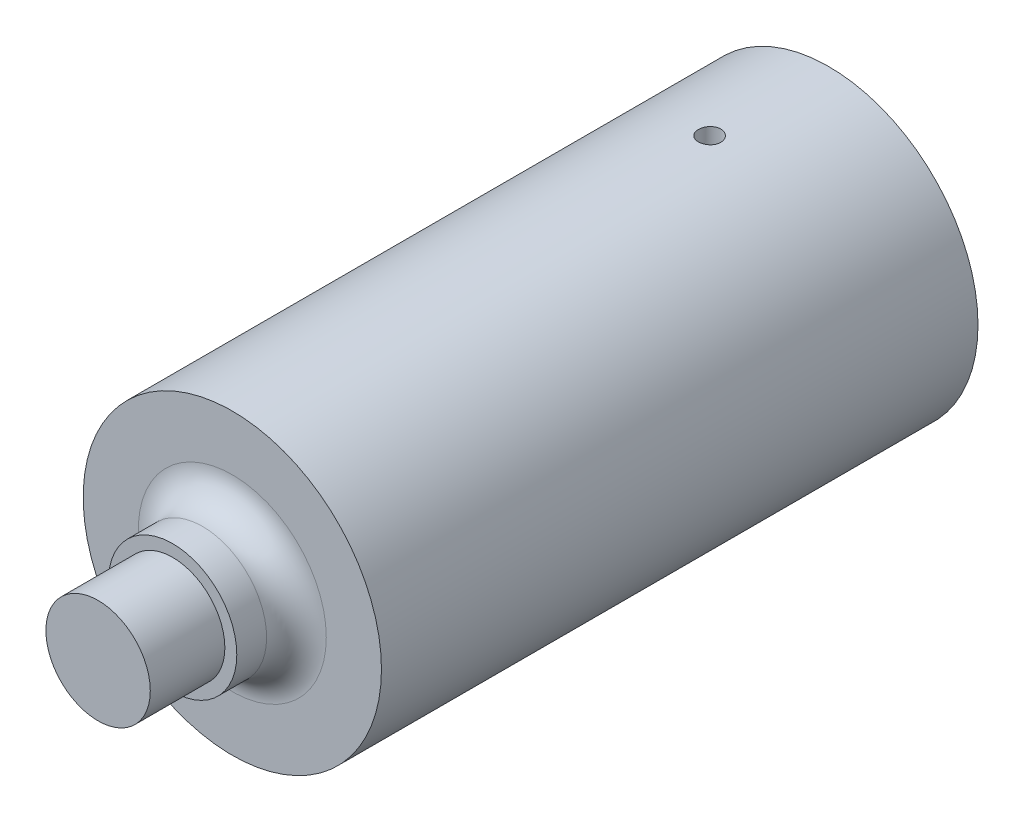
ISO-10303-21;
HEADER;
FILE_DESCRIPTION(('STEP AP214'),'2;1');
FILE_NAME('part.step','',(''),(''),'','','');
FILE_SCHEMA(('AUTOMOTIVE_DESIGN { 1 0 10303 214 1 1 1 1 }'));
ENDSEC;
DATA;
#1=APPLICATION_CONTEXT('core data for automotive mechanical design processes');
#2=APPLICATION_PROTOCOL_DEFINITION('international standard','automotive_design',2000,#1);
#3=PRODUCT_CONTEXT('',#1,'mechanical');
#4=PRODUCT('Part','Part','',(#3));
#5=PRODUCT_RELATED_PRODUCT_CATEGORY('part','',(#4));
#6=PRODUCT_DEFINITION_FORMATION('','',#4);
#7=PRODUCT_DEFINITION_CONTEXT('part definition',#1,'design');
#8=PRODUCT_DEFINITION('design','',#6,#7);
#9=PRODUCT_DEFINITION_SHAPE('','',#8);
#10=(LENGTH_UNIT() NAMED_UNIT(*) SI_UNIT(.MILLI.,.METRE.));
#11=(NAMED_UNIT(*) PLANE_ANGLE_UNIT() SI_UNIT($,.RADIAN.));
#12=(NAMED_UNIT(*) SI_UNIT($,.STERADIAN.) SOLID_ANGLE_UNIT());
#13=UNCERTAINTY_MEASURE_WITH_UNIT(LENGTH_MEASURE(1.E-05),#10,'distance_accuracy_value','');
#14=(GEOMETRIC_REPRESENTATION_CONTEXT(3) GLOBAL_UNCERTAINTY_ASSIGNED_CONTEXT((#13)) GLOBAL_UNIT_ASSIGNED_CONTEXT((#10,
#11,#12)) REPRESENTATION_CONTEXT('',''));
#15=CARTESIAN_POINT('',(0.,0.,0.));
#16=DIRECTION('',(0.,0.,1.));
#17=DIRECTION('',(1.,0.,0.));
#18=AXIS2_PLACEMENT_3D('',#15,#16,#17);
#19=CARTESIAN_POINT('',(2.07846096908265,-3.6,40.));
#20=DIRECTION('',(-0.866025403784439,0.5,0.));
#21=DIRECTION('',(-0.5,-0.866025403784439,0.));
#22=AXIS2_PLACEMENT_3D('',#19,#20,#21);
#23=PLANE('',#22);
#24=DIRECTION('',(0.,0.,-1.));
#25=VECTOR('',#24,1.);
#26=CARTESIAN_POINT('',(2.07846096908265,-3.6,40.));
#27=LINE('',#26,#25);
#28=CARTESIAN_POINT('',(2.07846096908265,-3.6,20.));
#29=VERTEX_POINT('',#28);
#30=CARTESIAN_POINT('',(2.07846096908265,-3.6,0.));
#31=VERTEX_POINT('',#30);
#32=EDGE_CURVE('E55',#29,#31,#27,.T.);
#33=ORIENTED_EDGE('',*,*,#32,.F.);
#34=DIRECTION('',(0.5,0.866025403784439,0.));
#35=VECTOR('',#34,1.);
#36=CARTESIAN_POINT('',(2.07846096908265,-3.6,20.));
#37=LINE('',#36,#35);
#38=CARTESIAN_POINT('',(4.15692193816531,0.,20.));
#39=VERTEX_POINT('',#38);
#40=EDGE_CURVE('E48',#29,#39,#37,.T.);
#41=ORIENTED_EDGE('',*,*,#40,.T.);
#42=DIRECTION('',(0.,0.,-1.));
#43=VECTOR('',#42,1.);
#44=CARTESIAN_POINT('',(4.15692193816531,0.,40.));
#45=LINE('',#44,#43);
#46=CARTESIAN_POINT('',(4.15692193816531,0.,0.));
#47=VERTEX_POINT('',#46);
#48=EDGE_CURVE('E114',#39,#47,#45,.T.);
#49=ORIENTED_EDGE('',*,*,#48,.T.);
#50=DIRECTION('',(0.5,0.866025403784439,0.));
#51=VECTOR('',#50,1.);
#52=CARTESIAN_POINT('',(2.07846096908265,-3.6,0.));
#53=LINE('',#52,#51);
#54=EDGE_CURVE('E183',#31,#47,#53,.T.);
#55=ORIENTED_EDGE('',*,*,#54,.F.);
#56=EDGE_LOOP('',(#33,#41,#49,#55));
#57=FACE_BOUND('',#56,.T.);
#58=ADVANCED_FACE('F33',(#57),#23,.T.);
#59=CARTESIAN_POINT('',(4.15692193816531,0.,40.));
#60=DIRECTION('',(-0.866025403784438,-0.5,0.));
#61=DIRECTION('',(0.5,-0.866025403784439,0.));
#62=AXIS2_PLACEMENT_3D('',#59,#60,#61);
#63=PLANE('',#62);
#64=ORIENTED_EDGE('',*,*,#48,.F.);
#65=DIRECTION('',(-0.5,0.866025403784439,0.));
#66=VECTOR('',#65,1.);
#67=CARTESIAN_POINT('',(4.15692193816531,0.,20.));
#68=LINE('',#67,#66);
#69=CARTESIAN_POINT('',(2.07846096908265,3.6,20.));
#70=VERTEX_POINT('',#69);
#71=EDGE_CURVE('E220',#39,#70,#68,.T.);
#72=ORIENTED_EDGE('',*,*,#71,.T.);
#73=DIRECTION('',(0.,0.,-1.));
#74=VECTOR('',#73,1.);
#75=CARTESIAN_POINT('',(2.07846096908265,3.6,40.));
#76=LINE('',#75,#74);
#77=CARTESIAN_POINT('',(2.07846096908265,3.6,0.));
#78=VERTEX_POINT('',#77);
#79=EDGE_CURVE('E112',#70,#78,#76,.T.);
#80=ORIENTED_EDGE('',*,*,#79,.T.);
#81=DIRECTION('',(-0.5,0.866025403784438,0.));
#82=VECTOR('',#81,1.);
#83=CARTESIAN_POINT('',(4.15692193816531,0.,0.));
#84=LINE('',#83,#82);
#85=EDGE_CURVE('E218',#47,#78,#84,.T.);
#86=ORIENTED_EDGE('',*,*,#85,.F.);
#87=EDGE_LOOP('',(#64,#72,#80,#86));
#88=FACE_BOUND('',#87,.T.);
#89=ADVANCED_FACE('F145',(#88),#63,.T.);
#90=CARTESIAN_POINT('',(2.07846096908265,3.6,40.));
#91=DIRECTION('',(0.,-1.,0.));
#92=DIRECTION('',(1.,0.,0.));
#93=AXIS2_PLACEMENT_3D('',#90,#91,#92);
#94=PLANE('',#93);
#95=CARTESIAN_POINT('',(0.,3.6,8.));
#96=DIRECTION('',(0.,-1.,0.));
#97=DIRECTION('',(1.,0.,0.));
#98=AXIS2_PLACEMENT_3D('',#95,#96,#97);
#99=CIRCLE('',#98,0.75);
#100=CARTESIAN_POINT('',(0.750000000000001,3.6,8.));
#101=VERTEX_POINT('',#100);
#102=EDGE_CURVE('E123',#101,#101,#99,.F.);
#103=ORIENTED_EDGE('',*,*,#102,.T.);
#104=EDGE_LOOP('',(#103));
#105=FACE_BOUND('',#104,.T.);
#106=ORIENTED_EDGE('',*,*,#79,.F.);
#107=DIRECTION('',(-1.,0.,0.));
#108=VECTOR('',#107,1.);
#109=CARTESIAN_POINT('',(2.07846096908265,3.6,20.));
#110=LINE('',#109,#108);
#111=CARTESIAN_POINT('',(-2.07846096908265,3.6,20.));
#112=VERTEX_POINT('',#111);
#113=EDGE_CURVE('E210',#70,#112,#110,.T.);
#114=ORIENTED_EDGE('',*,*,#113,.T.);
#115=DIRECTION('',(0.,0.,-1.));
#116=VECTOR('',#115,1.);
#117=CARTESIAN_POINT('',(-2.07846096908265,3.6,40.));
#118=LINE('',#117,#116);
#119=CARTESIAN_POINT('',(-2.07846096908265,3.6,0.));
#120=VERTEX_POINT('',#119);
#121=EDGE_CURVE('E106',#112,#120,#118,.T.);
#122=ORIENTED_EDGE('',*,*,#121,.T.);
#123=DIRECTION('',(-1.,0.,0.));
#124=VECTOR('',#123,1.);
#125=CARTESIAN_POINT('',(2.07846096908265,3.6,0.));
#126=LINE('',#125,#124);
#127=EDGE_CURVE('E213',#78,#120,#126,.T.);
#128=ORIENTED_EDGE('',*,*,#127,.F.);
#129=EDGE_LOOP('',(#106,#114,#122,#128));
#130=FACE_BOUND('',#129,.T.);
#131=ADVANCED_FACE('F151',(#105,#130),#94,.T.);
#132=CARTESIAN_POINT('',(-2.07846096908265,3.6,40.));
#133=DIRECTION('',(0.866025403784439,-0.5,0.));
#134=DIRECTION('',(0.5,0.866025403784439,0.));
#135=AXIS2_PLACEMENT_3D('',#132,#133,#134);
#136=PLANE('',#135);
#137=ORIENTED_EDGE('',*,*,#121,.F.);
#138=DIRECTION('',(-0.5,-0.866025403784439,0.));
#139=VECTOR('',#138,1.);
#140=CARTESIAN_POINT('',(-2.07846096908265,3.6,20.));
#141=LINE('',#140,#139);
#142=CARTESIAN_POINT('',(-4.1569219381653,0.,20.));
#143=VERTEX_POINT('',#142);
#144=EDGE_CURVE('E98',#112,#143,#141,.T.);
#145=ORIENTED_EDGE('',*,*,#144,.T.);
#146=DIRECTION('',(0.,0.,-1.));
#147=VECTOR('',#146,1.);
#148=CARTESIAN_POINT('',(-4.1569219381653,0.,40.));
#149=LINE('',#148,#147);
#150=CARTESIAN_POINT('',(-4.1569219381653,0.,0.));
#151=VERTEX_POINT('',#150);
#152=EDGE_CURVE('E97',#143,#151,#149,.T.);
#153=ORIENTED_EDGE('',*,*,#152,.T.);
#154=DIRECTION('',(-0.5,-0.866025403784439,0.));
#155=VECTOR('',#154,1.);
#156=CARTESIAN_POINT('',(-2.07846096908265,3.6,0.));
#157=LINE('',#156,#155);
#158=EDGE_CURVE('E351',#120,#151,#157,.T.);
#159=ORIENTED_EDGE('',*,*,#158,.F.);
#160=EDGE_LOOP('',(#137,#145,#153,#159));
#161=FACE_BOUND('',#160,.T.);
#162=ADVANCED_FACE('F197',(#161),#136,.T.);
#163=CARTESIAN_POINT('',(-4.1569219381653,0.,40.));
#164=DIRECTION('',(0.866025403784439,0.5,0.));
#165=DIRECTION('',(-0.5,0.866025403784439,0.));
#166=AXIS2_PLACEMENT_3D('',#163,#164,#165);
#167=PLANE('',#166);
#168=ORIENTED_EDGE('',*,*,#152,.F.);
#169=DIRECTION('',(0.5,-0.866025403784439,0.));
#170=VECTOR('',#169,1.);
#171=CARTESIAN_POINT('',(-4.1569219381653,0.,20.));
#172=LINE('',#171,#170);
#173=CARTESIAN_POINT('',(-2.07846096908265,-3.6,20.));
#174=VERTEX_POINT('',#173);
#175=EDGE_CURVE('E87',#143,#174,#172,.T.);
#176=ORIENTED_EDGE('',*,*,#175,.T.);
#177=DIRECTION('',(0.,0.,-1.));
#178=VECTOR('',#177,1.);
#179=CARTESIAN_POINT('',(-2.07846096908265,-3.6,40.));
#180=LINE('',#179,#178);
#181=CARTESIAN_POINT('',(-2.07846096908265,-3.6,0.));
#182=VERTEX_POINT('',#181);
#183=EDGE_CURVE('E96',#174,#182,#180,.T.);
#184=ORIENTED_EDGE('',*,*,#183,.T.);
#185=DIRECTION('',(0.5,-0.866025403784439,0.));
#186=VECTOR('',#185,1.);
#187=CARTESIAN_POINT('',(-4.1569219381653,0.,0.));
#188=LINE('',#187,#186);
#189=EDGE_CURVE('E353',#151,#182,#188,.T.);
#190=ORIENTED_EDGE('',*,*,#189,.F.);
#191=EDGE_LOOP('',(#168,#176,#184,#190));
#192=FACE_BOUND('',#191,.T.);
#193=ADVANCED_FACE('F94',(#192),#167,.T.);
#194=CARTESIAN_POINT('',(-2.07846096908265,-3.6,40.));
#195=DIRECTION('',(0.,1.,0.));
#196=DIRECTION('',(0.,0.,1.));
#197=AXIS2_PLACEMENT_3D('',#194,#195,#196);
#198=PLANE('',#197);
#199=CARTESIAN_POINT('',(0.,-3.6,8.));
#200=DIRECTION('',(0.,1.,0.));
#201=DIRECTION('',(0.,0.,1.));
#202=AXIS2_PLACEMENT_3D('',#199,#200,#201);
#203=CIRCLE('',#202,0.75);
#204=CARTESIAN_POINT('',(0.,-3.6,8.75));
#205=VERTEX_POINT('',#204);
#206=EDGE_CURVE('E121',#205,#205,#203,.F.);
#207=ORIENTED_EDGE('',*,*,#206,.T.);
#208=EDGE_LOOP('',(#207));
#209=FACE_BOUND('',#208,.T.);
#210=ORIENTED_EDGE('',*,*,#183,.F.);
#211=DIRECTION('',(1.,0.,0.));
#212=VECTOR('',#211,1.);
#213=CARTESIAN_POINT('',(-2.07846096908265,-3.6,20.));
#214=LINE('',#213,#212);
#215=EDGE_CURVE('E84',#174,#29,#214,.T.);
#216=ORIENTED_EDGE('',*,*,#215,.T.);
#217=ORIENTED_EDGE('',*,*,#32,.T.);
#218=DIRECTION('',(1.,0.,0.));
#219=VECTOR('',#218,1.);
#220=CARTESIAN_POINT('',(-2.07846096908265,-3.6,0.));
#221=LINE('',#220,#219);
#222=EDGE_CURVE('E103',#182,#31,#221,.T.);
#223=ORIENTED_EDGE('',*,*,#222,.F.);
#224=EDGE_LOOP('',(#210,#216,#217,#223));
#225=FACE_BOUND('',#224,.T.);
#226=ADVANCED_FACE('F101',(#209,#225),#198,.T.);
#227=CARTESIAN_POINT('',(0.,0.,40.));
#228=DIRECTION('',(0.,0.,-1.));
#229=DIRECTION('',(-1.,0.,0.));
#230=AXIS2_PLACEMENT_3D('',#227,#228,#229);
#231=CYLINDRICAL_SURFACE('',#230,10.);
#232=CARTESIAN_POINT('',(0.,0.,40.));
#233=DIRECTION('',(0.,0.,1.));
#234=DIRECTION('',(1.,0.,0.));
#235=AXIS2_PLACEMENT_3D('',#232,#233,#234);
#236=CIRCLE('',#235,10.);
#237=CARTESIAN_POINT('',(10.,0.,40.));
#238=VERTEX_POINT('',#237);
#239=EDGE_CURVE('E90',#238,#238,#236,.T.);
#240=ORIENTED_EDGE('',*,*,#239,.F.);
#241=EDGE_LOOP('',(#240));
#242=FACE_BOUND('',#241,.T.);
#243=CARTESIAN_POINT('',(0.,0.,0.));
#244=DIRECTION('',(0.,0.,1.));
#245=DIRECTION('',(1.,0.,0.));
#246=AXIS2_PLACEMENT_3D('',#243,#244,#245);
#247=CIRCLE('',#246,10.);
#248=CARTESIAN_POINT('',(10.,0.,0.));
#249=VERTEX_POINT('',#248);
#250=EDGE_CURVE('E116',#249,#249,#247,.T.);
#251=ORIENTED_EDGE('',*,*,#250,.T.);
#252=EDGE_LOOP('',(#251));
#253=FACE_BOUND('',#252,.T.);
#254=CARTESIAN_POINT('',(0.,-10.,7.25));
#255=CARTESIAN_POINT('',(0.0420644047557227,-9.99999962913644,7.25000184340851));
#256=CARTESIAN_POINT('',(0.0841578005120447,-9.9997317545379,7.2535507267203));
#257=CARTESIAN_POINT('',(0.16718097098577,-9.99868890393989,7.26765624227164));
#258=CARTESIAN_POINT('',(0.208109355581498,-9.99791334661944,7.27822090811849));
#259=CARTESIAN_POINT('',(0.28758798297991,-9.99594281342965,7.30605166405987));
#260=CARTESIAN_POINT('',(0.326139518467547,-9.99474806795054,7.32331407355425));
#261=CARTESIAN_POINT('',(0.39978824033901,-9.99207331235322,7.36404397643186));
#262=CARTESIAN_POINT('',(0.434886185899926,-9.99059336514136,7.38751010189798));
#263=CARTESIAN_POINT('',(0.500714478766273,-9.98751093449452,7.44003461026875));
#264=CARTESIAN_POINT('',(0.531436614859262,-9.98590822914549,7.46910327204211));
#265=CARTESIAN_POINT('',(0.587570826848911,-9.98276279192191,7.53198614867246));
#266=CARTESIAN_POINT('',(0.612982674521332,-9.98122006262731,7.56580056738703));
#267=CARTESIAN_POINT('',(0.657801919373829,-9.97836676979887,7.6372637274047));
#268=CARTESIAN_POINT('',(0.67720223405166,-9.977056480886,7.67491692251504));
#269=CARTESIAN_POINT('',(0.709402445233912,-9.97481880605083,7.7529576861719));
#270=CARTESIAN_POINT('',(0.722202438443439,-9.9738914145185,7.7933452146463));
#271=CARTESIAN_POINT('',(0.740815188289641,-9.9725262944501,7.87562694620028));
#272=CARTESIAN_POINT('',(0.746641155221086,-9.9720876402507,7.91751814540381));
#273=CARTESIAN_POINT('',(0.751181272874192,-9.97174669462697,8.00168597663035));
#274=CARTESIAN_POINT('',(0.749895534054289,-9.97184439487202,8.04396260265676));
#275=CARTESIAN_POINT('',(0.740259672087844,-9.97256428184655,8.12761090552694));
#276=CARTESIAN_POINT('',(0.731923878381972,-9.97318540469519,8.16898424348209));
#277=CARTESIAN_POINT('',(0.708446776134602,-9.97488047599021,8.24974284855779));
#278=CARTESIAN_POINT('',(0.693305412236681,-9.9759544281199,8.28912809950438));
#279=CARTESIAN_POINT('',(0.656630835948507,-9.97843536768068,8.36483835811942));
#280=CARTESIAN_POINT('',(0.635091163632483,-9.97984269140157,8.4011602250884));
#281=CARTESIAN_POINT('',(0.586236068717118,-9.98283147297571,8.46967833143244));
#282=CARTESIAN_POINT('',(0.558920551714386,-9.98441293367493,8.50187450336117));
#283=CARTESIAN_POINT('',(0.499208639216138,-9.98757651680734,8.56131062912179));
#284=CARTESIAN_POINT('',(0.466799850088158,-9.98915863121148,8.58853813379736));
#285=CARTESIAN_POINT('',(0.397864687967222,-9.99214150760496,8.63716788178285));
#286=CARTESIAN_POINT('',(0.361338312859297,-9.99354226950117,8.65857012210064));
#287=CARTESIAN_POINT('',(0.285196970108168,-9.99600480209642,8.69494091512188));
#288=CARTESIAN_POINT('',(0.245581754714489,-9.99706654556852,8.70990895112065));
#289=CARTESIAN_POINT('',(0.164390826387272,-9.99873107500663,8.73297790610242));
#290=CARTESIAN_POINT('',(0.122815146421287,-9.99933386868751,8.74107894051883));
#291=CARTESIAN_POINT('',(0.0389914218918759,-10.0000115867693,8.75016840476947));
#292=CARTESIAN_POINT('',(-0.00325474741266008,-10.0000877878789,8.75117403732709));
#293=CARTESIAN_POINT('',(-0.0873151154965314,-9.9997071385682,8.74608916596515));
#294=CARTESIAN_POINT('',(-0.129129317527298,-9.99925029216312,8.73999871549735));
#295=CARTESIAN_POINT('',(-0.211090005588251,-9.99785576876619,8.72090881559471));
#296=CARTESIAN_POINT('',(-0.251238350823034,-9.99691864430056,8.70791730472067));
#297=CARTESIAN_POINT('',(-0.328785163692013,-9.99466890454202,8.67540215318164));
#298=CARTESIAN_POINT('',(-0.366183595899698,-9.99335628441277,8.65587842838159));
#299=CARTESIAN_POINT('',(-0.437247479688379,-9.9904996627918,8.61080958105106));
#300=CARTESIAN_POINT('',(-0.470905660127773,-9.98895522387486,8.58525302164059));
#301=CARTESIAN_POINT('',(-0.533460298008509,-9.98581008196255,8.52886053726546));
#302=CARTESIAN_POINT('',(-0.562356688367402,-9.98420937817492,8.49802453793837));
#303=CARTESIAN_POINT('',(-0.61462617489577,-9.98112836879683,8.43187402993394));
#304=CARTESIAN_POINT('',(-0.637988073543826,-9.97964831120046,8.39655066028351));
#305=CARTESIAN_POINT('',(-0.67844872236304,-9.97697951427165,8.32247240080923));
#306=CARTESIAN_POINT('',(-0.695547524793443,-9.9757907725085,8.28371753962108));
#307=CARTESIAN_POINT('',(-0.722977396192289,-9.97384047836854,8.20391659625635));
#308=CARTESIAN_POINT('',(-0.733315403364552,-9.97307848815762,8.16287291007364));
#309=CARTESIAN_POINT('',(-0.746952846695885,-9.97206643262204,8.07962638449214));
#310=CARTESIAN_POINT('',(-0.75025238953694,-9.97181635953825,8.03742356267218));
#311=CARTESIAN_POINT('',(-0.749718107765774,-9.9718565345813,7.9531680433763));
#312=CARTESIAN_POINT('',(-0.745901880428615,-9.97214544979285,7.91111523255193));
#313=CARTESIAN_POINT('',(-0.731280990966987,-9.97322821847875,7.828249458145));
#314=CARTESIAN_POINT('',(-0.720476317216922,-9.97402207279308,7.7874364966251));
#315=CARTESIAN_POINT('',(-0.692189501367629,-9.97602492677799,7.7082071957891));
#316=CARTESIAN_POINT('',(-0.674707579204769,-9.97723391277475,7.66979077758373));
#317=CARTESIAN_POINT('',(-0.633564623098412,-9.9799308118954,7.59643552114272));
#318=CARTESIAN_POINT('',(-0.609903713405038,-9.98141871941042,7.5614966129991));
#319=CARTESIAN_POINT('',(-0.557008544733636,-9.98451015395811,7.49599832501448));
#320=CARTESIAN_POINT('',(-0.527761344100003,-9.98611394398152,7.46544940917995));
#321=CARTESIAN_POINT('',(-0.464545486726357,-9.98925406645788,7.40968297484458));
#322=CARTESIAN_POINT('',(-0.430575683897841,-9.99079038241667,7.38446675424697));
#323=CARTESIAN_POINT('',(-0.358825208301917,-9.99362470113832,7.34005441873044));
#324=CARTESIAN_POINT('',(-0.321038574133721,-9.99492232188758,7.32086791975448));
#325=CARTESIAN_POINT('',(-0.242796958957604,-9.99712833597881,7.28913585777985));
#326=CARTESIAN_POINT('',(-0.202345131868832,-9.99803718017026,7.27658259846587));
#327=CARTESIAN_POINT('',(-0.134708958362184,-9.99912781002897,7.26169900573653));
#328=CARTESIAN_POINT('',(-0.10796059646902,-9.9994534077319,7.25731764060529));
#329=CARTESIAN_POINT('',(-0.0541454939739934,-9.99988962186462,7.25146754742384));
#330=CARTESIAN_POINT('',(-0.0270787540345329,-10.0000002387416,7.24999881331482));
#331=CARTESIAN_POINT('',(0.,-10.,7.25));
#332=B_SPLINE_CURVE_WITH_KNOTS('',3,(#254,#255,#256,#257,#258,#259,#260,#261,#262,#263,#264,
#265,#266,#267,#268,#269,#270,#271,#272,#273,#274,#275,#276,#277,#278,#279,#280,#281,#282,#283,
#284,#285,#286,#287,#288,#289,#290,#291,#292,#293,#294,#295,#296,#297,#298,#299,#300,#301,#302,
#303,#304,#305,#306,#307,#308,#309,#310,#311,#312,#313,#314,#315,#316,#317,#318,#319,#320,#321,
#322,#323,#324,#325,#326,#327,#328,#329,#330,#331),.UNSPECIFIED.,.T.,.F.,(4,2,2,2,2,2,2,2,2,2,2,
2,2,2,2,2,2,2,2,2,2,2,2,2,2,2,2,2,2,2,2,2,2,2,2,2,2,2,4),(0.,0.126094353170702,
0.252333343558037,0.378503060068517,0.504644979372845,0.631020570667202,0.757401592183361,
0.883930948606271,1.01045845112212,1.13674590235185,1.26303139210068,1.38906081808215,
1.51509126920395,1.64124939949198,1.7674095919331,1.89388166818657,2.02035380940183,
2.14683610518214,2.27331627476949,2.39948968888266,2.52566215259152,2.65168978847614,
2.77771904766213,2.9039891760597,3.03026108315503,3.15678632557819,3.28331051225127,
3.4097046500346,3.53609687204868,3.66217694101203,3.78825721971578,3.9143333459235,
4.04040693712559,4.16677622314073,4.29317623036054,4.41977680385855,4.54623016281112,
4.62740295242378,4.70857557318191),.UNSPECIFIED.);
#333=CARTESIAN_POINT('',(0.,-10.,7.25));
#334=VERTEX_POINT('',#333);
#335=EDGE_CURVE('E170',#334,#334,#332,.T.);
#336=ORIENTED_EDGE('',*,*,#335,.F.);
#337=EDGE_LOOP('',(#336));
#338=FACE_BOUND('',#337,.T.);
#339=CARTESIAN_POINT('',(0.,10.,7.25));
#340=CARTESIAN_POINT('',(-0.0420644047557207,9.99999962913644,7.25000184340851));
#341=CARTESIAN_POINT('',(-0.0841578005120428,9.9997317545379,7.2535507267203));
#342=CARTESIAN_POINT('',(-0.167180970985768,9.99868890393989,7.26765624227164));
#343=CARTESIAN_POINT('',(-0.208109355581496,9.99791334661944,7.27822090811849));
#344=CARTESIAN_POINT('',(-0.287587982979908,9.99594281342965,7.30605166405987));
#345=CARTESIAN_POINT('',(-0.326139518467545,9.99474806795054,7.32331407355425));
#346=CARTESIAN_POINT('',(-0.399788240339009,9.99207331235322,7.36404397643186));
#347=CARTESIAN_POINT('',(-0.434886185899924,9.99059336514136,7.38751010189798));
#348=CARTESIAN_POINT('',(-0.500714478766271,9.98751093449452,7.44003461026875));
#349=CARTESIAN_POINT('',(-0.53143661485926,9.98590822914549,7.46910327204211));
#350=CARTESIAN_POINT('',(-0.587570826848909,9.98276279192191,7.53198614867246));
#351=CARTESIAN_POINT('',(-0.61298267452133,9.98122006262731,7.56580056738703));
#352=CARTESIAN_POINT('',(-0.657801919373827,9.97836676979887,7.6372637274047));
#353=CARTESIAN_POINT('',(-0.677202234051658,9.977056480886,7.67491692251504));
#354=CARTESIAN_POINT('',(-0.70940244523391,9.97481880605083,7.7529576861719));
#355=CARTESIAN_POINT('',(-0.722202438443437,9.9738914145185,7.7933452146463));
#356=CARTESIAN_POINT('',(-0.740815188289639,9.9725262944501,7.87562694620028));
#357=CARTESIAN_POINT('',(-0.746641155221084,9.9720876402507,7.91751814540381));
#358=CARTESIAN_POINT('',(-0.75118127287419,9.97174669462697,8.00168597663035));
#359=CARTESIAN_POINT('',(-0.749895534054287,9.97184439487202,8.04396260265676));
#360=CARTESIAN_POINT('',(-0.740259672087842,9.97256428184655,8.12761090552694));
#361=CARTESIAN_POINT('',(-0.73192387838197,9.97318540469519,8.16898424348209));
#362=CARTESIAN_POINT('',(-0.7084467761346,9.97488047599021,8.24974284855779));
#363=CARTESIAN_POINT('',(-0.693305412236679,9.9759544281199,8.28912809950438));
#364=CARTESIAN_POINT('',(-0.656630835948505,9.97843536768068,8.36483835811942));
#365=CARTESIAN_POINT('',(-0.635091163632481,9.97984269140157,8.4011602250884));
#366=CARTESIAN_POINT('',(-0.586236068717116,9.98283147297571,8.46967833143244));
#367=CARTESIAN_POINT('',(-0.558920551714384,9.98441293367493,8.50187450336117));
#368=CARTESIAN_POINT('',(-0.499208639216136,9.98757651680734,8.56131062912179));
#369=CARTESIAN_POINT('',(-0.466799850088156,9.98915863121148,8.58853813379736));
#370=CARTESIAN_POINT('',(-0.39786468796722,9.99214150760496,8.63716788178285));
#371=CARTESIAN_POINT('',(-0.361338312859295,9.99354226950117,8.65857012210064));
#372=CARTESIAN_POINT('',(-0.285196970108166,9.99600480209642,8.69494091512188));
#373=CARTESIAN_POINT('',(-0.245581754714488,9.99706654556852,8.70990895112065));
#374=CARTESIAN_POINT('',(-0.16439082638727,9.99873107500663,8.73297790610242));
#375=CARTESIAN_POINT('',(-0.122815146421285,9.99933386868751,8.74107894051883));
#376=CARTESIAN_POINT('',(-0.0389914218918739,10.0000115867693,8.75016840476947));
#377=CARTESIAN_POINT('',(0.003254747412662,10.0000877878789,8.75117403732709));
#378=CARTESIAN_POINT('',(0.0873151154965333,9.9997071385682,8.74608916596515));
#379=CARTESIAN_POINT('',(0.1291293175273,9.99925029216312,8.73999871549735));
#380=CARTESIAN_POINT('',(0.211090005588253,9.99785576876619,8.72090881559471));
#381=CARTESIAN_POINT('',(0.251238350823036,9.99691864430056,8.70791730472067));
#382=CARTESIAN_POINT('',(0.328785163692015,9.99466890454202,8.67540215318164));
#383=CARTESIAN_POINT('',(0.3661835958997,9.99335628441277,8.65587842838159));
#384=CARTESIAN_POINT('',(0.437247479688381,9.9904996627918,8.61080958105106));
#385=CARTESIAN_POINT('',(0.470905660127774,9.98895522387486,8.58525302164058));
#386=CARTESIAN_POINT('',(0.533460298008509,9.98581008196255,8.52886053726546));
#387=CARTESIAN_POINT('',(0.562356688367402,9.98420937817492,8.49802453793837));
#388=CARTESIAN_POINT('',(0.614626174895772,9.98112836879683,8.43187402993394));
#389=CARTESIAN_POINT('',(0.637988073543828,9.97964831120046,8.39655066028351));
#390=CARTESIAN_POINT('',(0.678448722363042,9.97697951427165,8.32247240080923));
#391=CARTESIAN_POINT('',(0.695547524793445,9.9757907725085,8.28371753962108));
#392=CARTESIAN_POINT('',(0.722977396192291,9.97384047836854,8.20391659625635));
#393=CARTESIAN_POINT('',(0.733315403364554,9.97307848815762,8.16287291007364));
#394=CARTESIAN_POINT('',(0.746952846695887,9.97206643262204,8.07962638449214));
#395=CARTESIAN_POINT('',(0.750252389536942,9.97181635953825,8.03742356267218));
#396=CARTESIAN_POINT('',(0.749718107765776,9.9718565345813,7.9531680433763));
#397=CARTESIAN_POINT('',(0.745901880428617,9.97214544979285,7.91111523255193));
#398=CARTESIAN_POINT('',(0.731280990966989,9.97322821847875,7.828249458145));
#399=CARTESIAN_POINT('',(0.720476317216924,9.97402207279308,7.7874364966251));
#400=CARTESIAN_POINT('',(0.692189501367631,9.97602492677799,7.7082071957891));
#401=CARTESIAN_POINT('',(0.674707579204771,9.97723391277475,7.66979077758373));
#402=CARTESIAN_POINT('',(0.633564623098414,9.9799308118954,7.59643552114272));
#403=CARTESIAN_POINT('',(0.60990371340504,9.98141871941042,7.5614966129991));
#404=CARTESIAN_POINT('',(0.557008544733639,9.98451015395811,7.49599832501448));
#405=CARTESIAN_POINT('',(0.527761344100006,9.98611394398152,7.46544940917995));
#406=CARTESIAN_POINT('',(0.464545486726361,9.98925406645788,7.40968297484458));
#407=CARTESIAN_POINT('',(0.430575683897845,9.99079038241667,7.38446675424697));
#408=CARTESIAN_POINT('',(0.35882520830192,9.99362470113832,7.34005441873044));
#409=CARTESIAN_POINT('',(0.321038574133723,9.99492232188758,7.32086791975448));
#410=CARTESIAN_POINT('',(0.242796958957606,9.99712833597881,7.28913585777985));
#411=CARTESIAN_POINT('',(0.202345131868834,9.99803718017026,7.27658259846587));
#412=CARTESIAN_POINT('',(0.134708958362186,9.99912781002897,7.26169900573653));
#413=CARTESIAN_POINT('',(0.107960596469023,9.9994534077319,7.25731764060529));
#414=CARTESIAN_POINT('',(0.0541454939739958,9.99988962186462,7.25146754742384));
#415=CARTESIAN_POINT('',(0.0270787540345351,10.0000002387416,7.24999881331482));
#416=CARTESIAN_POINT('',(0.,10.,7.25));
#417=B_SPLINE_CURVE_WITH_KNOTS('',3,(#339,#340,#341,#342,#343,#344,#345,#346,#347,#348,#349,
#350,#351,#352,#353,#354,#355,#356,#357,#358,#359,#360,#361,#362,#363,#364,#365,#366,#367,#368,
#369,#370,#371,#372,#373,#374,#375,#376,#377,#378,#379,#380,#381,#382,#383,#384,#385,#386,#387,
#388,#389,#390,#391,#392,#393,#394,#395,#396,#397,#398,#399,#400,#401,#402,#403,#404,#405,#406,
#407,#408,#409,#410,#411,#412,#413,#414,#415,#416),.UNSPECIFIED.,.T.,.F.,(4,2,2,2,2,2,2,2,2,2,2,
2,2,2,2,2,2,2,2,2,2,2,2,2,2,2,2,2,2,2,2,2,2,2,2,2,2,2,4),(0.,0.126094353170702,
0.252333343558037,0.378503060068517,0.504644979372845,0.631020570667202,0.757401592183361,
0.883930948606271,1.01045845112212,1.13674590235185,1.26303139210068,1.38906081808215,
1.51509126920395,1.64124939949198,1.7674095919331,1.89388166818657,2.02035380940183,
2.14683610518213,2.27331627476949,2.39948968888266,2.52566215259152,2.65168978847614,
2.77771904766213,2.9039891760597,3.03026108315502,3.15678632557819,3.28331051225127,
3.4097046500346,3.53609687204868,3.66217694101203,3.78825721971578,3.9143333459235,
4.04040693712559,4.16677622314073,4.29317623036054,4.41977680385855,4.54623016281111,
4.62740295242377,4.70857557318191),.UNSPECIFIED.);
#418=CARTESIAN_POINT('',(0.,10.,7.25));
#419=VERTEX_POINT('',#418);
#420=EDGE_CURVE('E177',#419,#419,#417,.T.);
#421=ORIENTED_EDGE('',*,*,#420,.F.);
#422=EDGE_LOOP('',(#421));
#423=FACE_BOUND('',#422,.T.);
#424=ADVANCED_FACE('F160',(#242,#253,#338,#423),#231,.T.);
#425=CARTESIAN_POINT('',(0.,0.,40.));
#426=DIRECTION('',(0.,0.,1.));
#427=DIRECTION('',(1.,0.,0.));
#428=AXIS2_PLACEMENT_3D('',#425,#426,#427);
#429=PLANE('',#428);
#430=CARTESIAN_POINT('',(0.,0.,40.));
#431=DIRECTION('',(0.,0.,1.));
#432=DIRECTION('',(1.,0.,0.));
#433=AXIS2_PLACEMENT_3D('',#430,#431,#432);
#434=CIRCLE('',#433,6.3);
#435=CARTESIAN_POINT('',(6.3,0.,40.));
#436=VERTEX_POINT('',#435);
#437=EDGE_CURVE('E11',#436,#436,#434,.F.);
#438=ORIENTED_EDGE('',*,*,#437,.T.);
#439=EDGE_LOOP('',(#438));
#440=FACE_BOUND('',#439,.T.);
#441=ORIENTED_EDGE('',*,*,#239,.T.);
#442=EDGE_LOOP('',(#441));
#443=FACE_BOUND('',#442,.T.);
#444=ADVANCED_FACE('F156',(#440,#443),#429,.T.);
#445=CARTESIAN_POINT('',(0.,0.,0.));
#446=DIRECTION('',(0.,0.,1.));
#447=DIRECTION('',(1.,0.,0.));
#448=AXIS2_PLACEMENT_3D('',#445,#446,#447);
#449=PLANE('',#448);
#450=ORIENTED_EDGE('',*,*,#250,.F.);
#451=EDGE_LOOP('',(#450));
#452=FACE_BOUND('',#451,.T.);
#453=ORIENTED_EDGE('',*,*,#54,.T.);
#454=ORIENTED_EDGE('',*,*,#85,.T.);
#455=ORIENTED_EDGE('',*,*,#127,.T.);
#456=ORIENTED_EDGE('',*,*,#158,.T.);
#457=ORIENTED_EDGE('',*,*,#189,.T.);
#458=ORIENTED_EDGE('',*,*,#222,.T.);
#459=EDGE_LOOP('',(#453,#454,#455,#456,#457,#458));
#460=FACE_BOUND('',#459,.T.);
#461=ADVANCED_FACE('F159',(#452,#460),#449,.F.);
#462=CARTESIAN_POINT('',(0.,40.,8.));
#463=DIRECTION('',(0.,-1.,0.));
#464=DIRECTION('',(0.,0.,-1.));
#465=AXIS2_PLACEMENT_3D('',#462,#463,#464);
#466=CYLINDRICAL_SURFACE('',#465,0.75);
#467=ORIENTED_EDGE('',*,*,#206,.F.);
#468=EDGE_LOOP('',(#467));
#469=FACE_BOUND('',#468,.T.);
#470=ORIENTED_EDGE('',*,*,#335,.T.);
#471=EDGE_LOOP('',(#470));
#472=FACE_BOUND('',#471,.T.);
#473=ADVANCED_FACE('F163',(#469,#472),#466,.F.);
#474=ORIENTED_EDGE('',*,*,#102,.F.);
#475=EDGE_LOOP('',(#474));
#476=FACE_BOUND('',#475,.T.);
#477=ORIENTED_EDGE('',*,*,#420,.T.);
#478=EDGE_LOOP('',(#477));
#479=FACE_BOUND('',#478,.T.);
#480=ADVANCED_FACE('F185',(#476,#479),#466,.F.);
#481=CARTESIAN_POINT('',(0.,0.,20.));
#482=DIRECTION('',(0.,0.,1.));
#483=DIRECTION('',(1.,0.,0.));
#484=AXIS2_PLACEMENT_3D('',#481,#482,#483);
#485=PLANE('',#484);
#486=ORIENTED_EDGE('',*,*,#40,.F.);
#487=ORIENTED_EDGE('',*,*,#215,.F.);
#488=ORIENTED_EDGE('',*,*,#175,.F.);
#489=ORIENTED_EDGE('',*,*,#144,.F.);
#490=ORIENTED_EDGE('',*,*,#113,.F.);
#491=ORIENTED_EDGE('',*,*,#71,.F.);
#492=EDGE_LOOP('',(#486,#487,#488,#489,#490,#491));
#493=FACE_BOUND('',#492,.T.);
#494=ADVANCED_FACE('F86',(#493),#485,.F.);
#495=CARTESIAN_POINT('',(0.,0.,44.));
#496=DIRECTION('',(0.,0.,-1.));
#497=DIRECTION('',(-1.,0.,0.));
#498=AXIS2_PLACEMENT_3D('',#495,#496,#497);
#499=CYLINDRICAL_SURFACE('',#498,4.3);
#500=CARTESIAN_POINT('',(0.,0.,42.));
#501=DIRECTION('',(0.,0.,1.));
#502=DIRECTION('',(1.,0.,0.));
#503=AXIS2_PLACEMENT_3D('',#500,#501,#502);
#504=CIRCLE('',#503,4.3);
#505=CARTESIAN_POINT('',(4.3,0.,42.));
#506=VERTEX_POINT('',#505);
#507=EDGE_CURVE('E41',#506,#506,#504,.T.);
#508=ORIENTED_EDGE('',*,*,#507,.T.);
#509=EDGE_LOOP('',(#508));
#510=FACE_BOUND('',#509,.T.);
#511=CARTESIAN_POINT('',(0.,0.,44.));
#512=DIRECTION('',(0.,0.,1.));
#513=DIRECTION('',(1.,0.,0.));
#514=AXIS2_PLACEMENT_3D('',#511,#512,#513);
#515=CIRCLE('',#514,4.3);
#516=CARTESIAN_POINT('',(4.3,0.,44.));
#517=VERTEX_POINT('',#516);
#518=EDGE_CURVE('E127',#517,#517,#515,.T.);
#519=ORIENTED_EDGE('',*,*,#518,.F.);
#520=EDGE_LOOP('',(#519));
#521=FACE_BOUND('',#520,.T.);
#522=ADVANCED_FACE('F131',(#510,#521),#499,.T.);
#523=CARTESIAN_POINT('',(0.,0.,44.));
#524=DIRECTION('',(0.,0.,1.));
#525=DIRECTION('',(1.,0.,0.));
#526=AXIS2_PLACEMENT_3D('',#523,#524,#525);
#527=PLANE('',#526);
#528=CARTESIAN_POINT('',(0.,0.,44.));
#529=DIRECTION('',(0.,0.,1.));
#530=DIRECTION('',(1.,0.,0.));
#531=AXIS2_PLACEMENT_3D('',#528,#529,#530);
#532=CIRCLE('',#531,3.5);
#533=CARTESIAN_POINT('',(3.5,0.,44.));
#534=VERTEX_POINT('',#533);
#535=EDGE_CURVE('E125',#534,#534,#532,.T.);
#536=ORIENTED_EDGE('',*,*,#535,.F.);
#537=EDGE_LOOP('',(#536));
#538=FACE_BOUND('',#537,.T.);
#539=ORIENTED_EDGE('',*,*,#518,.T.);
#540=EDGE_LOOP('',(#539));
#541=FACE_BOUND('',#540,.T.);
#542=ADVANCED_FACE('F257',(#538,#541),#527,.T.);
#543=CARTESIAN_POINT('',(0.,0.,49.));
#544=DIRECTION('',(0.,0.,1.));
#545=DIRECTION('',(1.,0.,0.));
#546=AXIS2_PLACEMENT_3D('',#543,#544,#545);
#547=PLANE('',#546);
#548=CARTESIAN_POINT('',(0.,0.,49.));
#549=DIRECTION('',(0.,0.,1.));
#550=DIRECTION('',(1.,0.,0.));
#551=AXIS2_PLACEMENT_3D('',#548,#549,#550);
#552=CIRCLE('',#551,3.5);
#553=CARTESIAN_POINT('',(3.5,0.,49.));
#554=VERTEX_POINT('',#553);
#555=EDGE_CURVE('E99',#554,#554,#552,.T.);
#556=ORIENTED_EDGE('',*,*,#555,.T.);
#557=EDGE_LOOP('',(#556));
#558=FACE_BOUND('',#557,.T.);
#559=ADVANCED_FACE('F140',(#558),#547,.T.);
#560=CARTESIAN_POINT('',(0.,0.,49.));
#561=DIRECTION('',(0.,0.,-1.));
#562=DIRECTION('',(-1.,0.,0.));
#563=AXIS2_PLACEMENT_3D('',#560,#561,#562);
#564=CYLINDRICAL_SURFACE('',#563,3.5);
#565=ORIENTED_EDGE('',*,*,#535,.T.);
#566=EDGE_LOOP('',(#565));
#567=FACE_BOUND('',#566,.T.);
#568=ORIENTED_EDGE('',*,*,#555,.F.);
#569=EDGE_LOOP('',(#568));
#570=FACE_BOUND('',#569,.T.);
#571=ADVANCED_FACE('F135',(#567,#570),#564,.T.);
#572=CARTESIAN_POINT('',(0.,0.,42.));
#573=DIRECTION('',(0.,0.,1.));
#574=DIRECTION('',(1.,0.,0.));
#575=AXIS2_PLACEMENT_3D('',#572,#573,#574);
#576=TOROIDAL_SURFACE('',#575,6.3,2.);
#577=ORIENTED_EDGE('',*,*,#437,.F.);
#578=EDGE_LOOP('',(#577));
#579=FACE_BOUND('',#578,.T.);
#580=ORIENTED_EDGE('',*,*,#507,.F.);
#581=EDGE_LOOP('',(#580));
#582=FACE_BOUND('',#581,.T.);
#583=ADVANCED_FACE('F35',(#579,#582),#576,.F.);
#584=CLOSED_SHELL('',(#58,#89,#131,#162,#193,#226,#424,#444,#461,#473,#480,#494,#522,#542,#559,
#571,#583));
#585=MANIFOLD_SOLID_BREP('B2',#584);
#586=ADVANCED_BREP_SHAPE_REPRESENTATION('',(#18,#585),#14);
#587=SHAPE_DEFINITION_REPRESENTATION(#9,#586);
ENDSEC;
END-ISO-10303-21;
